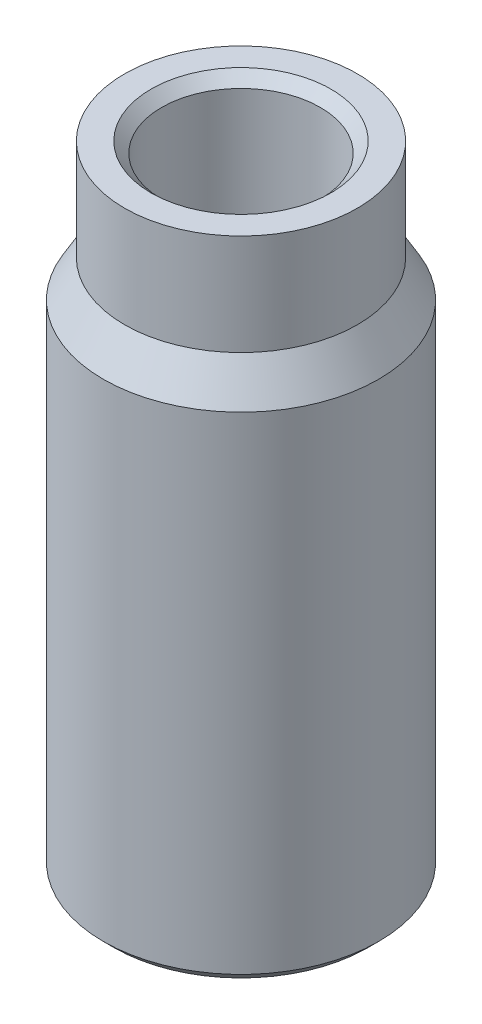
ISO-10303-21;
HEADER;
FILE_DESCRIPTION(('STEP AP214'),'2;1');
FILE_NAME('part.step','',(''),(''),'','','');
FILE_SCHEMA(('AUTOMOTIVE_DESIGN { 1 0 10303 214 1 1 1 1 }'));
ENDSEC;
DATA;
#1=APPLICATION_CONTEXT('core data for automotive mechanical design processes');
#2=APPLICATION_PROTOCOL_DEFINITION('international standard','automotive_design',2000,#1);
#3=PRODUCT_CONTEXT('',#1,'mechanical');
#4=PRODUCT('Part','Part','',(#3));
#5=PRODUCT_RELATED_PRODUCT_CATEGORY('part','',(#4));
#6=PRODUCT_DEFINITION_FORMATION('','',#4);
#7=PRODUCT_DEFINITION_CONTEXT('part definition',#1,'design');
#8=PRODUCT_DEFINITION('design','',#6,#7);
#9=PRODUCT_DEFINITION_SHAPE('','',#8);
#10=(LENGTH_UNIT() NAMED_UNIT(*) SI_UNIT(.MILLI.,.METRE.));
#11=(NAMED_UNIT(*) PLANE_ANGLE_UNIT() SI_UNIT($,.RADIAN.));
#12=(NAMED_UNIT(*) SI_UNIT($,.STERADIAN.) SOLID_ANGLE_UNIT());
#13=UNCERTAINTY_MEASURE_WITH_UNIT(LENGTH_MEASURE(1.E-05),#10,'distance_accuracy_value','');
#14=(GEOMETRIC_REPRESENTATION_CONTEXT(3) GLOBAL_UNCERTAINTY_ASSIGNED_CONTEXT((#13)) GLOBAL_UNIT_ASSIGNED_CONTEXT((#10,
#11,#12)) REPRESENTATION_CONTEXT('',''));
#15=CARTESIAN_POINT('',(0.,0.,0.));
#16=DIRECTION('',(0.,0.,1.));
#17=DIRECTION('',(1.,0.,0.));
#18=AXIS2_PLACEMENT_3D('',#15,#16,#17);
#19=CARTESIAN_POINT('',(0.,0.,0.));
#20=DIRECTION('',(0.,1.,0.));
#21=DIRECTION('',(0.,0.,1.));
#22=AXIS2_PLACEMENT_3D('',#19,#20,#21);
#23=CYLINDRICAL_SURFACE('',#22,7.5);
#24=CARTESIAN_POINT('',(0.,59.0000301368725,0.));
#25=DIRECTION('',(0.,1.,0.));
#26=DIRECTION('',(0.,0.,1.));
#27=AXIS2_PLACEMENT_3D('',#24,#25,#26);
#28=CIRCLE('',#27,7.5);
#29=CARTESIAN_POINT('',(0.,59.0000301368725,7.49999999999999));
#30=VERTEX_POINT('',#29);
#31=EDGE_CURVE('E20',#30,#30,#28,.T.);
#32=ORIENTED_EDGE('',*,*,#31,.T.);
#33=EDGE_LOOP('',(#32));
#34=FACE_BOUND('',#33,.T.);
#35=CARTESIAN_POINT('',(0.,0.999969863077519,0.));
#36=DIRECTION('',(0.,-1.,0.));
#37=DIRECTION('',(0.,0.,-1.));
#38=AXIS2_PLACEMENT_3D('',#35,#36,#37);
#39=CIRCLE('',#38,7.5);
#40=CARTESIAN_POINT('',(0.,0.999969863077519,-7.50000000000001));
#41=VERTEX_POINT('',#40);
#42=EDGE_CURVE('E57',#41,#41,#39,.T.);
#43=ORIENTED_EDGE('',*,*,#42,.T.);
#44=EDGE_LOOP('',(#43));
#45=FACE_BOUND('',#44,.T.);
#46=ADVANCED_FACE('F17',(#34,#45),#23,.F.);
#47=CARTESIAN_POINT('',(0.,60.0000170774951,0.));
#48=DIRECTION('',(0.,1.,0.));
#49=DIRECTION('',(0.,0.,1.));
#50=AXIS2_PLACEMENT_3D('',#47,#48,#49);
#51=CONICAL_SURFACE('',#50,8.49998292243629,0.785396154274);
#52=ORIENTED_EDGE('',*,*,#31,.F.);
#53=EDGE_LOOP('',(#52));
#54=FACE_BOUND('',#53,.T.);
#55=CARTESIAN_POINT('',(0.,60.,0.));
#56=DIRECTION('',(0.,1.,0.));
#57=DIRECTION('',(0.,0.,1.));
#58=AXIS2_PLACEMENT_3D('',#55,#56,#57);
#59=CIRCLE('',#58,8.49996584500979);
#60=CARTESIAN_POINT('',(0.,60.,8.49996584500978));
#61=VERTEX_POINT('',#60);
#62=EDGE_CURVE('E55',#61,#61,#59,.F.);
#63=ORIENTED_EDGE('',*,*,#62,.F.);
#64=EDGE_LOOP('',(#63));
#65=FACE_BOUND('',#64,.T.);
#66=ADVANCED_FACE('F65',(#54,#65),#51,.F.);
#67=CARTESIAN_POINT('',(0.,-1.70775201096315E-05,0.));
#68=DIRECTION('',(0.,-1.,0.));
#69=DIRECTION('',(0.,0.,-1.));
#70=AXIS2_PLACEMENT_3D('',#67,#68,#69);
#71=CONICAL_SURFACE('',#70,8.49998292241128,0.785396154273999);
#72=ORIENTED_EDGE('',*,*,#42,.F.);
#73=EDGE_LOOP('',(#72));
#74=FACE_BOUND('',#73,.T.);
#75=CARTESIAN_POINT('',(0.,0.,0.));
#76=DIRECTION('',(0.,1.,0.));
#77=DIRECTION('',(0.,0.,1.));
#78=AXIS2_PLACEMENT_3D('',#75,#76,#77);
#79=CIRCLE('',#78,8.49996584495979);
#80=CARTESIAN_POINT('',(0.,0.,8.49996584495979));
#81=VERTEX_POINT('',#80);
#82=EDGE_CURVE('E38',#81,#81,#79,.F.);
#83=ORIENTED_EDGE('',*,*,#82,.T.);
#84=EDGE_LOOP('',(#83));
#85=FACE_BOUND('',#84,.T.);
#86=ADVANCED_FACE('F68',(#74,#85),#71,.F.);
#87=CARTESIAN_POINT('',(0.,60.,0.));
#88=DIRECTION('',(0.,1.,0.));
#89=DIRECTION('',(0.,0.,1.));
#90=AXIS2_PLACEMENT_3D('',#87,#88,#89);
#91=PLANE('',#90);
#92=ORIENTED_EDGE('',*,*,#62,.T.);
#93=EDGE_LOOP('',(#92));
#94=FACE_BOUND('',#93,.T.);
#95=CARTESIAN_POINT('',(0.,60.,0.));
#96=DIRECTION('',(0.,1.,0.));
#97=DIRECTION('',(0.,0.,1.));
#98=AXIS2_PLACEMENT_3D('',#95,#96,#97);
#99=CIRCLE('',#98,11.);
#100=CARTESIAN_POINT('',(0.,60.,11.));
#101=VERTEX_POINT('',#100);
#102=EDGE_CURVE('E37',#101,#101,#99,.F.);
#103=ORIENTED_EDGE('',*,*,#102,.F.);
#104=EDGE_LOOP('',(#103));
#105=FACE_BOUND('',#104,.T.);
#106=ADVANCED_FACE('F71',(#94,#105),#91,.T.);
#107=CARTESIAN_POINT('',(0.,0.,0.));
#108=DIRECTION('',(0.,1.,0.));
#109=DIRECTION('',(0.,0.,1.));
#110=AXIS2_PLACEMENT_3D('',#107,#108,#109);
#111=PLANE('',#110);
#112=ORIENTED_EDGE('',*,*,#82,.F.);
#113=EDGE_LOOP('',(#112));
#114=FACE_BOUND('',#113,.T.);
#115=CARTESIAN_POINT('',(0.,0.,0.));
#116=DIRECTION('',(0.,1.,0.));
#117=DIRECTION('',(0.,0.,1.));
#118=AXIS2_PLACEMENT_3D('',#115,#116,#117);
#119=CIRCLE('',#118,12.0000043175497);
#120=CARTESIAN_POINT('',(0.,0.,12.0000043175497));
#121=VERTEX_POINT('',#120);
#122=EDGE_CURVE('E41',#121,#121,#119,.T.);
#123=ORIENTED_EDGE('',*,*,#122,.F.);
#124=EDGE_LOOP('',(#123));
#125=FACE_BOUND('',#124,.T.);
#126=ADVANCED_FACE('F74',(#114,#125),#111,.F.);
#127=CARTESIAN_POINT('',(0.,47.,0.));
#128=DIRECTION('',(0.,1.,0.));
#129=DIRECTION('',(0.,0.,1.));
#130=AXIS2_PLACEMENT_3D('',#127,#128,#129);
#131=CYLINDRICAL_SURFACE('',#130,11.);
#132=ORIENTED_EDGE('',*,*,#102,.T.);
#133=EDGE_LOOP('',(#132));
#134=FACE_BOUND('',#133,.T.);
#135=CARTESIAN_POINT('',(0.,50.464112894581,0.));
#136=DIRECTION('',(0.,-1.,0.));
#137=DIRECTION('',(1.,0.,0.));
#138=AXIS2_PLACEMENT_3D('',#135,#136,#137);
#139=CIRCLE('',#138,11.);
#140=CARTESIAN_POINT('',(-11.000002441945,50.4641030252702,-1.45088342997285E-07));
#141=VERTEX_POINT('',#140);
#142=CARTESIAN_POINT('',(11.000002441945,50.4641030252702,0.));
#143=VERTEX_POINT('',#142);
#144=EDGE_CURVE('E36',#141,#143,#139,.T.);
#145=ORIENTED_EDGE('',*,*,#144,.F.);
#146=CARTESIAN_POINT('',(0.,50.4641044349728,0.));
#147=DIRECTION('',(0.,-1.,0.));
#148=DIRECTION('',(-1.17926266462E-09,0.,-1.));
#149=AXIS2_PLACEMENT_3D('',#146,#147,#148);
#150=CIRCLE('',#149,11.00000488416);
#151=EDGE_CURVE('E32',#143,#141,#150,.T.);
#152=ORIENTED_EDGE('',*,*,#151,.F.);
#153=EDGE_LOOP('',(#145,#152));
#154=FACE_BOUND('',#153,.T.);
#155=ADVANCED_FACE('F35',(#134,#154),#131,.T.);
#156=CARTESIAN_POINT('',(0.,0.99999766132856,0.));
#157=DIRECTION('',(0.,1.,0.));
#158=DIRECTION('',(0.,0.,1.));
#159=AXIS2_PLACEMENT_3D('',#156,#157,#158);
#160=CONICAL_SURFACE('',#159,13.0000023386706,0.785398343294);
#161=CARTESIAN_POINT('',(0.,0.999997660921,0.));
#162=DIRECTION('',(0.,1.,0.));
#163=DIRECTION('',(0.,0.,1.));
#164=AXIS2_PLACEMENT_3D('',#161,#162,#163);
#165=CIRCLE('',#164,13.);
#166=CARTESIAN_POINT('',(0.,0.999997660921,13.));
#167=VERTEX_POINT('',#166);
#168=EDGE_CURVE('E26',#167,#167,#165,.T.);
#169=ORIENTED_EDGE('',*,*,#168,.F.);
#170=EDGE_LOOP('',(#169));
#171=FACE_BOUND('',#170,.T.);
#172=ORIENTED_EDGE('',*,*,#122,.T.);
#173=EDGE_LOOP('',(#172));
#174=FACE_BOUND('',#173,.T.);
#175=ADVANCED_FACE('F79',(#171,#174),#160,.T.);
#176=CARTESIAN_POINT('',(0.,47.000003332567,0.));
#177=DIRECTION('',(0.,-1.,0.));
#178=DIRECTION('',(1.,0.,0.));
#179=AXIS2_PLACEMENT_3D('',#176,#177,#178);
#180=CONICAL_SURFACE('',#179,13.0000057721719,0.52359903195);
#181=CARTESIAN_POINT('',(0.,47.000013330256,0.));
#182=DIRECTION('',(0.,-1.,0.));
#183=DIRECTION('',(1.,0.,0.));
#184=AXIS2_PLACEMENT_3D('',#181,#182,#183);
#185=CIRCLE('',#184,13.);
#186=CARTESIAN_POINT('',(13.,47.000013330256,0.));
#187=VERTEX_POINT('',#186);
#188=EDGE_CURVE('E11',#187,#187,#185,.T.);
#189=ORIENTED_EDGE('',*,*,#188,.F.);
#190=EDGE_LOOP('',(#189));
#191=FACE_BOUND('',#190,.T.);
#192=ORIENTED_EDGE('',*,*,#144,.T.);
#193=ORIENTED_EDGE('',*,*,#151,.T.);
#194=EDGE_LOOP('',(#192,#193));
#195=FACE_BOUND('',#194,.T.);
#196=ADVANCED_FACE('F40',(#191,#195),#180,.T.);
#197=CARTESIAN_POINT('',(0.,0.,0.));
#198=DIRECTION('',(0.,1.,0.));
#199=DIRECTION('',(0.,0.,1.));
#200=AXIS2_PLACEMENT_3D('',#197,#198,#199);
#201=CYLINDRICAL_SURFACE('',#200,13.);
#202=ORIENTED_EDGE('',*,*,#168,.T.);
#203=EDGE_LOOP('',(#202));
#204=FACE_BOUND('',#203,.T.);
#205=ORIENTED_EDGE('',*,*,#188,.T.);
#206=EDGE_LOOP('',(#205));
#207=FACE_BOUND('',#206,.T.);
#208=ADVANCED_FACE('F90',(#204,#207),#201,.T.);
#209=CLOSED_SHELL('',(#46,#66,#86,#106,#126,#155,#175,#196,#208));
#210=MANIFOLD_SOLID_BREP('B1',#209);
#211=ADVANCED_BREP_SHAPE_REPRESENTATION('',(#18,#210),#14);
#212=SHAPE_DEFINITION_REPRESENTATION(#9,#211);
ENDSEC;
END-ISO-10303-21;
